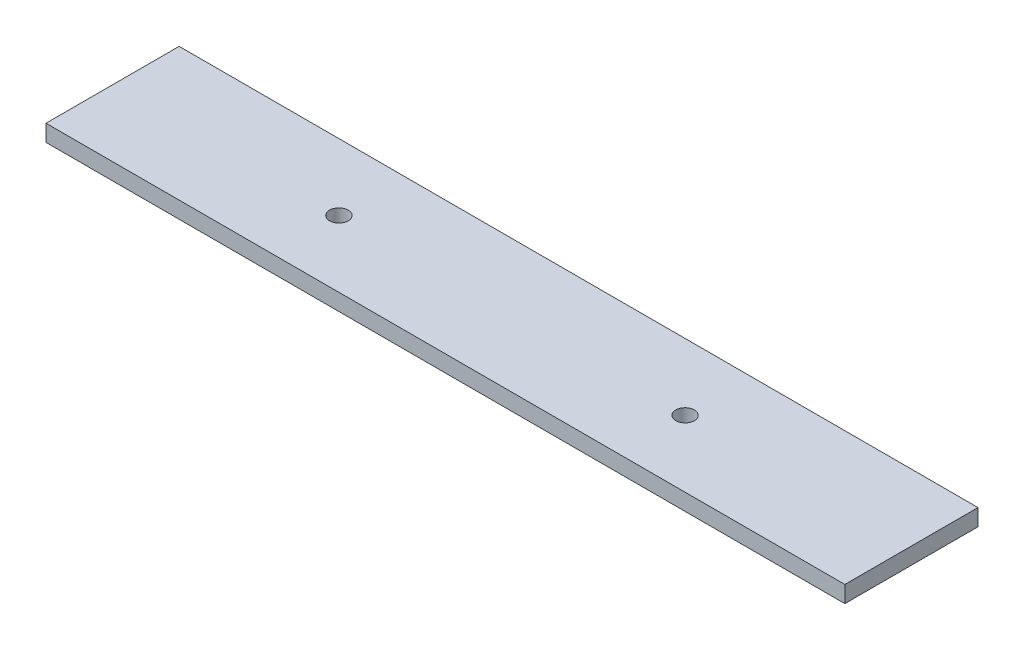
ISO-10303-21;
HEADER;
FILE_DESCRIPTION(('STEP AP214'),'2;1');
FILE_NAME('part.step','',(''),(''),'','','');
FILE_SCHEMA(('AUTOMOTIVE_DESIGN { 1 0 10303 214 1 1 1 1 }'));
ENDSEC;
DATA;
#1=APPLICATION_CONTEXT('core data for automotive mechanical design processes');
#2=APPLICATION_PROTOCOL_DEFINITION('international standard','automotive_design',2000,#1);
#3=PRODUCT_CONTEXT('',#1,'mechanical');
#4=PRODUCT('Part','Part','',(#3));
#5=PRODUCT_RELATED_PRODUCT_CATEGORY('part','',(#4));
#6=PRODUCT_DEFINITION_FORMATION('','',#4);
#7=PRODUCT_DEFINITION_CONTEXT('part definition',#1,'design');
#8=PRODUCT_DEFINITION('design','',#6,#7);
#9=PRODUCT_DEFINITION_SHAPE('','',#8);
#10=(LENGTH_UNIT() NAMED_UNIT(*) SI_UNIT(.MILLI.,.METRE.));
#11=(NAMED_UNIT(*) PLANE_ANGLE_UNIT() SI_UNIT($,.RADIAN.));
#12=(NAMED_UNIT(*) SI_UNIT($,.STERADIAN.) SOLID_ANGLE_UNIT());
#13=UNCERTAINTY_MEASURE_WITH_UNIT(LENGTH_MEASURE(1.E-05),#10,'distance_accuracy_value','');
#14=(GEOMETRIC_REPRESENTATION_CONTEXT(3) GLOBAL_UNCERTAINTY_ASSIGNED_CONTEXT((#13)) GLOBAL_UNIT_ASSIGNED_CONTEXT((#10,
#11,#12)) REPRESENTATION_CONTEXT('',''));
#15=CARTESIAN_POINT('',(0.,0.,0.));
#16=DIRECTION('',(0.,0.,1.));
#17=DIRECTION('',(1.,0.,0.));
#18=AXIS2_PLACEMENT_3D('',#15,#16,#17);
#19=CARTESIAN_POINT('',(0.,6.35,0.));
#20=DIRECTION('',(0.,1.,0.));
#21=DIRECTION('',(0.,0.,1.));
#22=AXIS2_PLACEMENT_3D('',#19,#20,#21);
#23=PLANE('',#22);
#24=CARTESIAN_POINT('',(-66.04,6.35,0.));
#25=DIRECTION('',(0.,1.,0.));
#26=DIRECTION('',(0.,0.,1.));
#27=AXIS2_PLACEMENT_3D('',#24,#25,#26);
#28=CIRCLE('',#27,3.556);
#29=CARTESIAN_POINT('',(-66.04,6.35,3.556));
#30=VERTEX_POINT('',#29);
#31=EDGE_CURVE('E100',#30,#30,#28,.T.);
#32=ORIENTED_EDGE('',*,*,#31,.F.);
#33=EDGE_LOOP('',(#32));
#34=FACE_BOUND('',#33,.T.);
#35=DIRECTION('',(0.,0.,1.));
#36=VECTOR('',#35,1.);
#37=CARTESIAN_POINT('',(-152.4,6.35,25.4));
#38=LINE('',#37,#36);
#39=CARTESIAN_POINT('',(-152.4,6.35,-25.4));
#40=VERTEX_POINT('',#39);
#41=CARTESIAN_POINT('',(-152.4,6.35,25.4));
#42=VERTEX_POINT('',#41);
#43=EDGE_CURVE('E85',#40,#42,#38,.T.);
#44=ORIENTED_EDGE('',*,*,#43,.T.);
#45=DIRECTION('',(1.,0.,0.));
#46=VECTOR('',#45,1.);
#47=CARTESIAN_POINT('',(152.4,6.35,25.4));
#48=LINE('',#47,#46);
#49=CARTESIAN_POINT('',(152.4,6.35,25.4));
#50=VERTEX_POINT('',#49);
#51=EDGE_CURVE('E80',#42,#50,#48,.T.);
#52=ORIENTED_EDGE('',*,*,#51,.T.);
#53=DIRECTION('',(0.,0.,-1.));
#54=VECTOR('',#53,1.);
#55=CARTESIAN_POINT('',(152.4,6.35,25.4));
#56=LINE('',#55,#54);
#57=CARTESIAN_POINT('',(152.4,6.35,-25.4));
#58=VERTEX_POINT('',#57);
#59=EDGE_CURVE('E83',#50,#58,#56,.T.);
#60=ORIENTED_EDGE('',*,*,#59,.T.);
#61=DIRECTION('',(-1.,0.,0.));
#62=VECTOR('',#61,1.);
#63=CARTESIAN_POINT('',(152.4,6.35,-25.4));
#64=LINE('',#63,#62);
#65=EDGE_CURVE('E50',#58,#40,#64,.T.);
#66=ORIENTED_EDGE('',*,*,#65,.T.);
#67=EDGE_LOOP('',(#44,#52,#60,#66));
#68=FACE_BOUND('',#67,.T.);
#69=CARTESIAN_POINT('',(66.04,6.35,0.));
#70=DIRECTION('',(0.,1.,0.));
#71=DIRECTION('',(0.,0.,1.));
#72=AXIS2_PLACEMENT_3D('',#69,#70,#71);
#73=CIRCLE('',#72,3.55600000000001);
#74=CARTESIAN_POINT('',(66.04,6.35,3.55600000000001));
#75=VERTEX_POINT('',#74);
#76=EDGE_CURVE('E115',#75,#75,#73,.T.);
#77=ORIENTED_EDGE('',*,*,#76,.F.);
#78=EDGE_LOOP('',(#77));
#79=FACE_BOUND('',#78,.T.);
#80=ADVANCED_FACE('F33',(#34,#68,#79),#23,.T.);
#81=CARTESIAN_POINT('',(0.,0.,0.));
#82=DIRECTION('',(0.,1.,0.));
#83=DIRECTION('',(0.,0.,1.));
#84=AXIS2_PLACEMENT_3D('',#81,#82,#83);
#85=PLANE('',#84);
#86=DIRECTION('',(0.,0.,1.));
#87=VECTOR('',#86,1.);
#88=CARTESIAN_POINT('',(-152.4,0.,25.4));
#89=LINE('',#88,#87);
#90=CARTESIAN_POINT('',(-152.4,0.,-25.4));
#91=VERTEX_POINT('',#90);
#92=CARTESIAN_POINT('',(-152.4,0.,25.4));
#93=VERTEX_POINT('',#92);
#94=EDGE_CURVE('E97',#91,#93,#89,.T.);
#95=ORIENTED_EDGE('',*,*,#94,.F.);
#96=DIRECTION('',(-1.,0.,0.));
#97=VECTOR('',#96,1.);
#98=CARTESIAN_POINT('',(152.4,0.,-25.4));
#99=LINE('',#98,#97);
#100=CARTESIAN_POINT('',(152.4,0.,-25.4));
#101=VERTEX_POINT('',#100);
#102=EDGE_CURVE('E73',#101,#91,#99,.T.);
#103=ORIENTED_EDGE('',*,*,#102,.F.);
#104=DIRECTION('',(0.,0.,-1.));
#105=VECTOR('',#104,1.);
#106=CARTESIAN_POINT('',(152.4,0.,25.4));
#107=LINE('',#106,#105);
#108=CARTESIAN_POINT('',(152.4,0.,25.4));
#109=VERTEX_POINT('',#108);
#110=EDGE_CURVE('E67',#109,#101,#107,.T.);
#111=ORIENTED_EDGE('',*,*,#110,.F.);
#112=DIRECTION('',(1.,0.,0.));
#113=VECTOR('',#112,1.);
#114=CARTESIAN_POINT('',(152.4,0.,25.4));
#115=LINE('',#114,#113);
#116=EDGE_CURVE('E89',#93,#109,#115,.T.);
#117=ORIENTED_EDGE('',*,*,#116,.F.);
#118=EDGE_LOOP('',(#95,#103,#111,#117));
#119=FACE_BOUND('',#118,.T.);
#120=CARTESIAN_POINT('',(-66.04,0.,0.));
#121=DIRECTION('',(0.,1.,0.));
#122=DIRECTION('',(0.,0.,1.));
#123=AXIS2_PLACEMENT_3D('',#120,#121,#122);
#124=CIRCLE('',#123,3.556);
#125=CARTESIAN_POINT('',(-66.04,0.,3.556));
#126=VERTEX_POINT('',#125);
#127=EDGE_CURVE('E112',#126,#126,#124,.T.);
#128=ORIENTED_EDGE('',*,*,#127,.T.);
#129=EDGE_LOOP('',(#128));
#130=FACE_BOUND('',#129,.T.);
#131=CARTESIAN_POINT('',(66.04,0.,0.));
#132=DIRECTION('',(0.,1.,0.));
#133=DIRECTION('',(0.,0.,1.));
#134=AXIS2_PLACEMENT_3D('',#131,#132,#133);
#135=CIRCLE('',#134,3.55600000000001);
#136=CARTESIAN_POINT('',(66.04,0.,3.55600000000001));
#137=VERTEX_POINT('',#136);
#138=EDGE_CURVE('E118',#137,#137,#135,.T.);
#139=ORIENTED_EDGE('',*,*,#138,.T.);
#140=EDGE_LOOP('',(#139));
#141=FACE_BOUND('',#140,.T.);
#142=ADVANCED_FACE('F108',(#119,#130,#141),#85,.F.);
#143=CARTESIAN_POINT('',(-152.4,6.35,25.4));
#144=DIRECTION('',(1.,0.,0.));
#145=DIRECTION('',(0.,0.,-1.));
#146=AXIS2_PLACEMENT_3D('',#143,#144,#145);
#147=PLANE('',#146);
#148=ORIENTED_EDGE('',*,*,#94,.T.);
#149=DIRECTION('',(0.,-1.,0.));
#150=VECTOR('',#149,1.);
#151=CARTESIAN_POINT('',(-152.4,6.35,25.4));
#152=LINE('',#151,#150);
#153=EDGE_CURVE('E11',#42,#93,#152,.T.);
#154=ORIENTED_EDGE('',*,*,#153,.F.);
#155=ORIENTED_EDGE('',*,*,#43,.F.);
#156=DIRECTION('',(0.,-1.,0.));
#157=VECTOR('',#156,1.);
#158=CARTESIAN_POINT('',(-152.4,6.35,-25.4));
#159=LINE('',#158,#157);
#160=EDGE_CURVE('E93',#40,#91,#159,.T.);
#161=ORIENTED_EDGE('',*,*,#160,.T.);
#162=EDGE_LOOP('',(#148,#154,#155,#161));
#163=FACE_BOUND('',#162,.T.);
#164=ADVANCED_FACE('F35',(#163),#147,.F.);
#165=CARTESIAN_POINT('',(152.4,6.35,25.4));
#166=DIRECTION('',(0.,0.,-1.));
#167=DIRECTION('',(-1.,0.,0.));
#168=AXIS2_PLACEMENT_3D('',#165,#166,#167);
#169=PLANE('',#168);
#170=ORIENTED_EDGE('',*,*,#116,.T.);
#171=DIRECTION('',(0.,-1.,0.));
#172=VECTOR('',#171,1.);
#173=CARTESIAN_POINT('',(152.4,6.35,25.4));
#174=LINE('',#173,#172);
#175=EDGE_CURVE('E42',#50,#109,#174,.T.);
#176=ORIENTED_EDGE('',*,*,#175,.F.);
#177=ORIENTED_EDGE('',*,*,#51,.F.);
#178=ORIENTED_EDGE('',*,*,#153,.T.);
#179=EDGE_LOOP('',(#170,#176,#177,#178));
#180=FACE_BOUND('',#179,.T.);
#181=ADVANCED_FACE('F88',(#180),#169,.F.);
#182=CARTESIAN_POINT('',(152.4,6.35,25.4));
#183=DIRECTION('',(-1.,0.,0.));
#184=DIRECTION('',(0.,0.,1.));
#185=AXIS2_PLACEMENT_3D('',#182,#183,#184);
#186=PLANE('',#185);
#187=ORIENTED_EDGE('',*,*,#110,.T.);
#188=DIRECTION('',(0.,-1.,0.));
#189=VECTOR('',#188,1.);
#190=CARTESIAN_POINT('',(152.4,6.35,-25.4));
#191=LINE('',#190,#189);
#192=EDGE_CURVE('E90',#58,#101,#191,.T.);
#193=ORIENTED_EDGE('',*,*,#192,.F.);
#194=ORIENTED_EDGE('',*,*,#59,.F.);
#195=ORIENTED_EDGE('',*,*,#175,.T.);
#196=EDGE_LOOP('',(#187,#193,#194,#195));
#197=FACE_BOUND('',#196,.T.);
#198=ADVANCED_FACE('F91',(#197),#186,.F.);
#199=CARTESIAN_POINT('',(152.4,6.35,-25.4));
#200=DIRECTION('',(0.,0.,1.));
#201=DIRECTION('',(1.,0.,0.));
#202=AXIS2_PLACEMENT_3D('',#199,#200,#201);
#203=PLANE('',#202);
#204=ORIENTED_EDGE('',*,*,#102,.T.);
#205=ORIENTED_EDGE('',*,*,#160,.F.);
#206=ORIENTED_EDGE('',*,*,#65,.F.);
#207=ORIENTED_EDGE('',*,*,#192,.T.);
#208=EDGE_LOOP('',(#204,#205,#206,#207));
#209=FACE_BOUND('',#208,.T.);
#210=ADVANCED_FACE('F105',(#209),#203,.F.);
#211=CARTESIAN_POINT('',(-66.04,6.35,0.));
#212=DIRECTION('',(0.,-1.,0.));
#213=DIRECTION('',(0.,0.,-1.));
#214=AXIS2_PLACEMENT_3D('',#211,#212,#213);
#215=CYLINDRICAL_SURFACE('',#214,3.556);
#216=ORIENTED_EDGE('',*,*,#31,.T.);
#217=EDGE_LOOP('',(#216));
#218=FACE_BOUND('',#217,.T.);
#219=ORIENTED_EDGE('',*,*,#127,.F.);
#220=EDGE_LOOP('',(#219));
#221=FACE_BOUND('',#220,.T.);
#222=ADVANCED_FACE('F135',(#218,#221),#215,.F.);
#223=CARTESIAN_POINT('',(66.04,6.35,0.));
#224=DIRECTION('',(0.,-1.,0.));
#225=DIRECTION('',(0.,0.,-1.));
#226=AXIS2_PLACEMENT_3D('',#223,#224,#225);
#227=CYLINDRICAL_SURFACE('',#226,3.55600000000001);
#228=ORIENTED_EDGE('',*,*,#76,.T.);
#229=EDGE_LOOP('',(#228));
#230=FACE_BOUND('',#229,.T.);
#231=ORIENTED_EDGE('',*,*,#138,.F.);
#232=EDGE_LOOP('',(#231));
#233=FACE_BOUND('',#232,.T.);
#234=ADVANCED_FACE('F124',(#230,#233),#227,.F.);
#235=CLOSED_SHELL('',(#80,#142,#164,#181,#198,#210,#222,#234));
#236=MANIFOLD_SOLID_BREP('B2',#235);
#237=ADVANCED_BREP_SHAPE_REPRESENTATION('',(#18,#236),#14);
#238=SHAPE_DEFINITION_REPRESENTATION(#9,#237);
ENDSEC;
END-ISO-10303-21;
